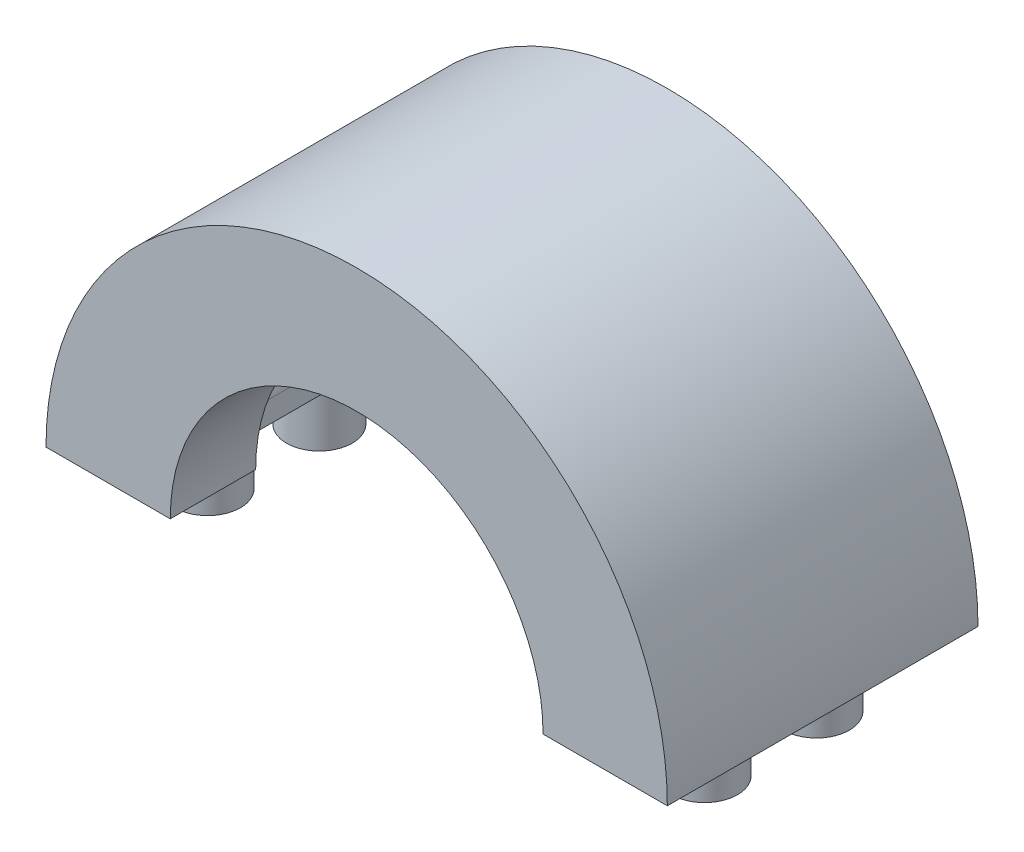
ISO-10303-21;
HEADER;
FILE_DESCRIPTION(('STEP AP214'),'2;1');
FILE_NAME('part.step','',(''),(''),'','','');
FILE_SCHEMA(('AUTOMOTIVE_DESIGN { 1 0 10303 214 1 1 1 1 }'));
ENDSEC;
DATA;
#1=APPLICATION_CONTEXT('core data for automotive mechanical design processes');
#2=APPLICATION_PROTOCOL_DEFINITION('international standard','automotive_design',2000,#1);
#3=PRODUCT_CONTEXT('',#1,'mechanical');
#4=PRODUCT('Part','Part','',(#3));
#5=PRODUCT_RELATED_PRODUCT_CATEGORY('part','',(#4));
#6=PRODUCT_DEFINITION_FORMATION('','',#4);
#7=PRODUCT_DEFINITION_CONTEXT('part definition',#1,'design');
#8=PRODUCT_DEFINITION('design','',#6,#7);
#9=PRODUCT_DEFINITION_SHAPE('','',#8);
#10=(LENGTH_UNIT() NAMED_UNIT(*) SI_UNIT(.MILLI.,.METRE.));
#11=(NAMED_UNIT(*) PLANE_ANGLE_UNIT() SI_UNIT($,.RADIAN.));
#12=(NAMED_UNIT(*) SI_UNIT($,.STERADIAN.) SOLID_ANGLE_UNIT());
#13=UNCERTAINTY_MEASURE_WITH_UNIT(LENGTH_MEASURE(1.E-05),#10,'distance_accuracy_value','');
#14=(GEOMETRIC_REPRESENTATION_CONTEXT(3) GLOBAL_UNCERTAINTY_ASSIGNED_CONTEXT((#13)) GLOBAL_UNIT_ASSIGNED_CONTEXT((#10,
#11,#12)) REPRESENTATION_CONTEXT('',''));
#15=CARTESIAN_POINT('',(0.,0.,0.));
#16=DIRECTION('',(0.,0.,1.));
#17=DIRECTION('',(1.,0.,0.));
#18=AXIS2_PLACEMENT_3D('',#15,#16,#17);
#19=CARTESIAN_POINT('',(0.,0.,12.5));
#20=DIRECTION('',(0.,0.,-1.));
#21=DIRECTION('',(-1.,0.,0.));
#22=AXIS2_PLACEMENT_3D('',#19,#20,#21);
#23=CYLINDRICAL_SURFACE('',#22,15.);
#24=DIRECTION('',(0.,0.,-1.));
#25=VECTOR('',#24,1.);
#26=CARTESIAN_POINT('',(12.6835301079786,8.008,5.628));
#27=LINE('',#26,#25);
#28=CARTESIAN_POINT('',(12.6835301079786,8.008,5.628));
#29=VERTEX_POINT('',#28);
#30=CARTESIAN_POINT('',(12.6835301079786,8.008,-5.628));
#31=VERTEX_POINT('',#30);
#32=EDGE_CURVE('E282',#29,#31,#27,.T.);
#33=ORIENTED_EDGE('',*,*,#32,.F.);
#34=CARTESIAN_POINT('',(0.,0.,5.628));
#35=DIRECTION('',(0.,0.,1.));
#36=DIRECTION('',(1.,0.,0.));
#37=AXIS2_PLACEMENT_3D('',#34,#35,#36);
#38=CIRCLE('',#37,15.);
#39=CARTESIAN_POINT('',(15.,0.,5.628));
#40=VERTEX_POINT('',#39);
#41=EDGE_CURVE('E262',#40,#29,#38,.T.);
#42=ORIENTED_EDGE('',*,*,#41,.F.);
#43=DIRECTION('',(0.,0.,-1.));
#44=VECTOR('',#43,1.);
#45=CARTESIAN_POINT('',(15.,0.,12.5));
#46=LINE('',#45,#44);
#47=CARTESIAN_POINT('',(15.,0.,12.5));
#48=VERTEX_POINT('',#47);
#49=EDGE_CURVE('E394',#48,#40,#46,.T.);
#50=ORIENTED_EDGE('',*,*,#49,.F.);
#51=CARTESIAN_POINT('',(0.,0.,12.5));
#52=DIRECTION('',(0.,0.,1.));
#53=DIRECTION('',(1.,0.,0.));
#54=AXIS2_PLACEMENT_3D('',#51,#52,#53);
#55=CIRCLE('',#54,15.);
#56=CARTESIAN_POINT('',(-15.,0.,12.5));
#57=VERTEX_POINT('',#56);
#58=EDGE_CURVE('E376',#48,#57,#55,.T.);
#59=ORIENTED_EDGE('',*,*,#58,.T.);
#60=DIRECTION('',(0.,0.,-1.));
#61=VECTOR('',#60,1.);
#62=CARTESIAN_POINT('',(-15.,0.,12.5));
#63=LINE('',#62,#61);
#64=CARTESIAN_POINT('',(-15.,0.,5.628));
#65=VERTEX_POINT('',#64);
#66=EDGE_CURVE('E399',#57,#65,#63,.T.);
#67=ORIENTED_EDGE('',*,*,#66,.T.);
#68=CARTESIAN_POINT('',(0.,0.,5.628));
#69=DIRECTION('',(0.,0.,-1.));
#70=DIRECTION('',(-1.,0.,0.));
#71=AXIS2_PLACEMENT_3D('',#68,#69,#70);
#72=CIRCLE('',#71,15.);
#73=CARTESIAN_POINT('',(-12.6835301079786,8.008,5.628));
#74=VERTEX_POINT('',#73);
#75=EDGE_CURVE('E312',#65,#74,#72,.T.);
#76=ORIENTED_EDGE('',*,*,#75,.T.);
#77=DIRECTION('',(0.,0.,-1.));
#78=VECTOR('',#77,1.);
#79=CARTESIAN_POINT('',(-12.6835301079786,8.008,5.628));
#80=LINE('',#79,#78);
#81=CARTESIAN_POINT('',(-12.6835301079786,8.008,-5.628));
#82=VERTEX_POINT('',#81);
#83=EDGE_CURVE('E354',#74,#82,#80,.T.);
#84=ORIENTED_EDGE('',*,*,#83,.T.);
#85=CARTESIAN_POINT('',(0.,0.,-5.628));
#86=DIRECTION('',(0.,0.,-1.));
#87=DIRECTION('',(-1.,0.,0.));
#88=AXIS2_PLACEMENT_3D('',#85,#86,#87);
#89=CIRCLE('',#88,15.);
#90=CARTESIAN_POINT('',(-15.,0.,-5.628));
#91=VERTEX_POINT('',#90);
#92=EDGE_CURVE('E305',#91,#82,#89,.T.);
#93=ORIENTED_EDGE('',*,*,#92,.F.);
#94=CARTESIAN_POINT('',(-15.,0.,-12.5));
#95=VERTEX_POINT('',#94);
#96=EDGE_CURVE('E398',#91,#95,#63,.T.);
#97=ORIENTED_EDGE('',*,*,#96,.T.);
#98=CARTESIAN_POINT('',(0.,0.,-12.5));
#99=DIRECTION('',(0.,0.,1.));
#100=DIRECTION('',(1.,0.,0.));
#101=AXIS2_PLACEMENT_3D('',#98,#99,#100);
#102=CIRCLE('',#101,15.);
#103=CARTESIAN_POINT('',(15.,0.,-12.5));
#104=VERTEX_POINT('',#103);
#105=EDGE_CURVE('E370',#104,#95,#102,.T.);
#106=ORIENTED_EDGE('',*,*,#105,.F.);
#107=CARTESIAN_POINT('',(15.,0.,-5.628));
#108=VERTEX_POINT('',#107);
#109=EDGE_CURVE('E380',#108,#104,#46,.T.);
#110=ORIENTED_EDGE('',*,*,#109,.F.);
#111=CARTESIAN_POINT('',(0.,0.,-5.628));
#112=DIRECTION('',(0.,0.,1.));
#113=DIRECTION('',(1.,0.,0.));
#114=AXIS2_PLACEMENT_3D('',#111,#112,#113);
#115=CIRCLE('',#114,15.);
#116=EDGE_CURVE('E257',#108,#31,#115,.T.);
#117=ORIENTED_EDGE('',*,*,#116,.T.);
#118=EDGE_LOOP('',(#33,#42,#50,#59,#67,#76,#84,#93,#97,#106,#110,#117));
#119=FACE_BOUND('',#118,.T.);
#120=ADVANCED_FACE('F41',(#119),#23,.F.);
#121=CARTESIAN_POINT('',(15.,0.,12.5));
#122=DIRECTION('',(0.,1.,0.));
#123=DIRECTION('',(-1.,0.,0.));
#124=AXIS2_PLACEMENT_3D('',#121,#122,#123);
#125=PLANE('',#124);
#126=DIRECTION('',(0.,0.,-1.));
#127=VECTOR('',#126,1.);
#128=CARTESIAN_POINT('',(17.5936,0.,-5.628));
#129=LINE('',#128,#127);
#130=CARTESIAN_POINT('',(17.5936,0.,3.3955457897676));
#131=VERTEX_POINT('',#130);
#132=CARTESIAN_POINT('',(17.5936,0.,-3.3955457897676));
#133=VERTEX_POINT('',#132);
#134=EDGE_CURVE('E218',#131,#133,#129,.T.);
#135=ORIENTED_EDGE('',*,*,#134,.T.);
#136=CARTESIAN_POINT('',(20.,0.,-4.5));
#137=DIRECTION('',(0.,1.,0.));
#138=DIRECTION('',(1.,0.,0.));
#139=AXIS2_PLACEMENT_3D('',#136,#137,#138);
#140=CIRCLE('',#139,2.64775);
#141=CARTESIAN_POINT('',(17.5936,0.,-5.6044542102324));
#142=VERTEX_POINT('',#141);
#143=EDGE_CURVE('E215',#133,#142,#140,.T.);
#144=ORIENTED_EDGE('',*,*,#143,.T.);
#145=CARTESIAN_POINT('',(17.5936,0.,-5.628));
#146=VERTEX_POINT('',#145);
#147=EDGE_CURVE('E201',#142,#146,#129,.T.);
#148=ORIENTED_EDGE('',*,*,#147,.T.);
#149=DIRECTION('',(1.,0.,0.));
#150=VECTOR('',#149,1.);
#151=CARTESIAN_POINT('',(0.,0.,-5.628));
#152=LINE('',#151,#150);
#153=EDGE_CURVE('E267',#108,#146,#152,.T.);
#154=ORIENTED_EDGE('',*,*,#153,.F.);
#155=ORIENTED_EDGE('',*,*,#109,.T.);
#156=DIRECTION('',(1.,0.,0.));
#157=VECTOR('',#156,1.);
#158=CARTESIAN_POINT('',(15.,0.,-12.5));
#159=LINE('',#158,#157);
#160=CARTESIAN_POINT('',(25.,0.,-12.5));
#161=VERTEX_POINT('',#160);
#162=EDGE_CURVE('E358',#104,#161,#159,.T.);
#163=ORIENTED_EDGE('',*,*,#162,.T.);
#164=DIRECTION('',(0.,0.,-1.));
#165=VECTOR('',#164,1.);
#166=CARTESIAN_POINT('',(25.,0.,12.5));
#167=LINE('',#166,#165);
#168=CARTESIAN_POINT('',(25.,0.,12.5));
#169=VERTEX_POINT('',#168);
#170=EDGE_CURVE('E407',#169,#161,#167,.T.);
#171=ORIENTED_EDGE('',*,*,#170,.F.);
#172=DIRECTION('',(1.,0.,0.));
#173=VECTOR('',#172,1.);
#174=CARTESIAN_POINT('',(15.,0.,12.5));
#175=LINE('',#174,#173);
#176=EDGE_CURVE('E365',#48,#169,#175,.T.);
#177=ORIENTED_EDGE('',*,*,#176,.F.);
#178=ORIENTED_EDGE('',*,*,#49,.T.);
#179=DIRECTION('',(1.,0.,0.));
#180=VECTOR('',#179,1.);
#181=CARTESIAN_POINT('',(0.,0.,5.628));
#182=LINE('',#181,#180);
#183=CARTESIAN_POINT('',(17.5936,0.,5.628));
#184=VERTEX_POINT('',#183);
#185=EDGE_CURVE('E279',#40,#184,#182,.T.);
#186=ORIENTED_EDGE('',*,*,#185,.T.);
#187=CARTESIAN_POINT('',(17.5936,0.,5.6044542102324));
#188=VERTEX_POINT('',#187);
#189=EDGE_CURVE('E213',#184,#188,#129,.T.);
#190=ORIENTED_EDGE('',*,*,#189,.T.);
#191=CARTESIAN_POINT('',(20.,0.,4.5));
#192=DIRECTION('',(0.,1.,0.));
#193=DIRECTION('',(-1.,0.,0.));
#194=AXIS2_PLACEMENT_3D('',#191,#192,#193);
#195=CIRCLE('',#194,2.64775);
#196=EDGE_CURVE('E241',#188,#131,#195,.T.);
#197=ORIENTED_EDGE('',*,*,#196,.T.);
#198=EDGE_LOOP('',(#135,#144,#148,#154,#155,#163,#171,#177,#178,#186,#190,#197));
#199=FACE_BOUND('',#198,.T.);
#200=ADVANCED_FACE('F216',(#199),#125,.F.);
#201=CARTESIAN_POINT('',(-25.,0.,12.5));
#202=DIRECTION('',(0.,1.,0.));
#203=DIRECTION('',(-1.,0.,0.));
#204=AXIS2_PLACEMENT_3D('',#201,#202,#203);
#205=PLANE('',#204);
#206=CARTESIAN_POINT('',(-20.,0.,-4.5));
#207=DIRECTION('',(0.,-1.,0.));
#208=DIRECTION('',(-1.,0.,0.));
#209=AXIS2_PLACEMENT_3D('',#206,#207,#208);
#210=CIRCLE('',#209,2.64775);
#211=CARTESIAN_POINT('',(-17.5936,0.,-3.39554578976763));
#212=VERTEX_POINT('',#211);
#213=CARTESIAN_POINT('',(-17.5936,0.,-5.60445421023237));
#214=VERTEX_POINT('',#213);
#215=EDGE_CURVE('E240',#212,#214,#210,.T.);
#216=ORIENTED_EDGE('',*,*,#215,.F.);
#217=DIRECTION('',(0.,0.,1.));
#218=VECTOR('',#217,1.);
#219=CARTESIAN_POINT('',(-17.5936,0.,12.5));
#220=LINE('',#219,#218);
#221=CARTESIAN_POINT('',(-17.5936,0.,3.39554578976763));
#222=VERTEX_POINT('',#221);
#223=EDGE_CURVE('E453',#212,#222,#220,.T.);
#224=ORIENTED_EDGE('',*,*,#223,.T.);
#225=CARTESIAN_POINT('',(-20.,0.,4.5));
#226=DIRECTION('',(0.,-1.,0.));
#227=DIRECTION('',(1.,0.,0.));
#228=AXIS2_PLACEMENT_3D('',#225,#226,#227);
#229=CIRCLE('',#228,2.64775);
#230=CARTESIAN_POINT('',(-17.5936,0.,5.60445421023237));
#231=VERTEX_POINT('',#230);
#232=EDGE_CURVE('E258',#231,#222,#229,.T.);
#233=ORIENTED_EDGE('',*,*,#232,.F.);
#234=CARTESIAN_POINT('',(-17.5936,0.,5.628));
#235=VERTEX_POINT('',#234);
#236=EDGE_CURVE('E447',#231,#235,#220,.T.);
#237=ORIENTED_EDGE('',*,*,#236,.T.);
#238=DIRECTION('',(-1.,0.,0.));
#239=VECTOR('',#238,1.);
#240=CARTESIAN_POINT('',(0.,0.,5.628));
#241=LINE('',#240,#239);
#242=EDGE_CURVE('E316',#65,#235,#241,.T.);
#243=ORIENTED_EDGE('',*,*,#242,.F.);
#244=ORIENTED_EDGE('',*,*,#66,.F.);
#245=DIRECTION('',(1.,0.,0.));
#246=VECTOR('',#245,1.);
#247=CARTESIAN_POINT('',(-25.,0.,12.5));
#248=LINE('',#247,#246);
#249=CARTESIAN_POINT('',(-25.,0.,12.5));
#250=VERTEX_POINT('',#249);
#251=EDGE_CURVE('E373',#250,#57,#248,.T.);
#252=ORIENTED_EDGE('',*,*,#251,.F.);
#253=DIRECTION('',(0.,0.,-1.));
#254=VECTOR('',#253,1.);
#255=CARTESIAN_POINT('',(-25.,0.,12.5));
#256=LINE('',#255,#254);
#257=CARTESIAN_POINT('',(-25.,0.,-12.5));
#258=VERTEX_POINT('',#257);
#259=EDGE_CURVE('E403',#250,#258,#256,.T.);
#260=ORIENTED_EDGE('',*,*,#259,.T.);
#261=DIRECTION('',(1.,0.,0.));
#262=VECTOR('',#261,1.);
#263=CARTESIAN_POINT('',(-25.,0.,-12.5));
#264=LINE('',#263,#262);
#265=EDGE_CURVE('E387',#258,#95,#264,.T.);
#266=ORIENTED_EDGE('',*,*,#265,.T.);
#267=ORIENTED_EDGE('',*,*,#96,.F.);
#268=DIRECTION('',(-1.,0.,0.));
#269=VECTOR('',#268,1.);
#270=CARTESIAN_POINT('',(0.,0.,-5.628));
#271=LINE('',#270,#269);
#272=CARTESIAN_POINT('',(-17.5936,0.,-5.628));
#273=VERTEX_POINT('',#272);
#274=EDGE_CURVE('E338',#91,#273,#271,.T.);
#275=ORIENTED_EDGE('',*,*,#274,.T.);
#276=EDGE_CURVE('E448',#273,#214,#220,.T.);
#277=ORIENTED_EDGE('',*,*,#276,.T.);
#278=EDGE_LOOP('',(#216,#224,#233,#237,#243,#244,#252,#260,#266,#267,#275,#277));
#279=FACE_BOUND('',#278,.T.);
#280=ADVANCED_FACE('F474',(#279),#205,.F.);
#281=CARTESIAN_POINT('',(0.,0.,12.5));
#282=DIRECTION('',(0.,0.,-1.));
#283=DIRECTION('',(-1.,0.,0.));
#284=AXIS2_PLACEMENT_3D('',#281,#282,#283);
#285=CYLINDRICAL_SURFACE('',#284,25.);
#286=CARTESIAN_POINT('',(0.,0.,-12.5));
#287=DIRECTION('',(0.,0.,1.));
#288=DIRECTION('',(1.,0.,0.));
#289=AXIS2_PLACEMENT_3D('',#286,#287,#288);
#290=CIRCLE('',#289,25.);
#291=EDGE_CURVE('E384',#161,#258,#290,.T.);
#292=ORIENTED_EDGE('',*,*,#291,.T.);
#293=ORIENTED_EDGE('',*,*,#259,.F.);
#294=CARTESIAN_POINT('',(0.,0.,12.5));
#295=DIRECTION('',(0.,0.,1.));
#296=DIRECTION('',(1.,0.,0.));
#297=AXIS2_PLACEMENT_3D('',#294,#295,#296);
#298=CIRCLE('',#297,25.);
#299=EDGE_CURVE('E369',#169,#250,#298,.T.);
#300=ORIENTED_EDGE('',*,*,#299,.F.);
#301=ORIENTED_EDGE('',*,*,#170,.T.);
#302=EDGE_LOOP('',(#292,#293,#300,#301));
#303=FACE_BOUND('',#302,.T.);
#304=ADVANCED_FACE('F552',(#303),#285,.T.);
#305=CARTESIAN_POINT('',(0.,0.,12.5));
#306=DIRECTION('',(0.,0.,1.));
#307=DIRECTION('',(1.,0.,0.));
#308=AXIS2_PLACEMENT_3D('',#305,#306,#307);
#309=PLANE('',#308);
#310=ORIENTED_EDGE('',*,*,#176,.T.);
#311=ORIENTED_EDGE('',*,*,#299,.T.);
#312=ORIENTED_EDGE('',*,*,#251,.T.);
#313=ORIENTED_EDGE('',*,*,#58,.F.);
#314=EDGE_LOOP('',(#310,#311,#312,#313));
#315=FACE_BOUND('',#314,.T.);
#316=ADVANCED_FACE('F554',(#315),#309,.T.);
#317=CARTESIAN_POINT('',(0.,0.,-12.5));
#318=DIRECTION('',(0.,0.,1.));
#319=DIRECTION('',(1.,0.,0.));
#320=AXIS2_PLACEMENT_3D('',#317,#318,#319);
#321=PLANE('',#320);
#322=ORIENTED_EDGE('',*,*,#162,.F.);
#323=ORIENTED_EDGE('',*,*,#105,.T.);
#324=ORIENTED_EDGE('',*,*,#265,.F.);
#325=ORIENTED_EDGE('',*,*,#291,.F.);
#326=EDGE_LOOP('',(#322,#323,#324,#325));
#327=FACE_BOUND('',#326,.T.);
#328=ADVANCED_FACE('F547',(#327),#321,.F.);
#329=CARTESIAN_POINT('',(0.,8.008,5.628));
#330=DIRECTION('',(0.,1.,0.));
#331=DIRECTION('',(0.,0.,1.));
#332=AXIS2_PLACEMENT_3D('',#329,#330,#331);
#333=PLANE('',#332);
#334=DIRECTION('',(1.,0.,0.));
#335=VECTOR('',#334,1.);
#336=CARTESIAN_POINT('',(0.,8.008,-5.628));
#337=LINE('',#336,#335);
#338=CARTESIAN_POINT('',(-16.6576,8.008,-5.628));
#339=VERTEX_POINT('',#338);
#340=EDGE_CURVE('E317',#339,#82,#337,.T.);
#341=ORIENTED_EDGE('',*,*,#340,.T.);
#342=ORIENTED_EDGE('',*,*,#83,.F.);
#343=DIRECTION('',(1.,0.,0.));
#344=VECTOR('',#343,1.);
#345=CARTESIAN_POINT('',(0.,8.008,5.628));
#346=LINE('',#345,#344);
#347=CARTESIAN_POINT('',(-16.6576,8.008,5.628));
#348=VERTEX_POINT('',#347);
#349=EDGE_CURVE('E331',#348,#74,#346,.T.);
#350=ORIENTED_EDGE('',*,*,#349,.F.);
#351=DIRECTION('',(0.,0.,-1.));
#352=VECTOR('',#351,1.);
#353=CARTESIAN_POINT('',(-16.6576,8.008,5.628));
#354=LINE('',#353,#352);
#355=EDGE_CURVE('E359',#348,#339,#354,.T.);
#356=ORIENTED_EDGE('',*,*,#355,.T.);
#357=EDGE_LOOP('',(#341,#342,#350,#356));
#358=FACE_BOUND('',#357,.T.);
#359=ADVANCED_FACE('F578',(#358),#333,.F.);
#360=CARTESIAN_POINT('',(-16.6576,0.,5.628));
#361=DIRECTION('',(-1.,0.,0.));
#362=DIRECTION('',(0.,0.,1.));
#363=AXIS2_PLACEMENT_3D('',#360,#361,#362);
#364=PLANE('',#363);
#365=DIRECTION('',(0.,1.,0.));
#366=VECTOR('',#365,1.);
#367=CARTESIAN_POINT('',(-16.6576,0.,-5.628));
#368=LINE('',#367,#366);
#369=CARTESIAN_POINT('',(-16.6576,5.712,-5.628));
#370=VERTEX_POINT('',#369);
#371=EDGE_CURVE('E347',#370,#339,#368,.T.);
#372=ORIENTED_EDGE('',*,*,#371,.T.);
#373=ORIENTED_EDGE('',*,*,#355,.F.);
#374=DIRECTION('',(0.,1.,0.));
#375=VECTOR('',#374,1.);
#376=CARTESIAN_POINT('',(-16.6576,0.,5.628));
#377=LINE('',#376,#375);
#378=CARTESIAN_POINT('',(-16.6576,5.712,5.628));
#379=VERTEX_POINT('',#378);
#380=EDGE_CURVE('E327',#379,#348,#377,.T.);
#381=ORIENTED_EDGE('',*,*,#380,.F.);
#382=DIRECTION('',(0.,0.,-1.));
#383=VECTOR('',#382,1.);
#384=CARTESIAN_POINT('',(-16.6576,5.712,5.628));
#385=LINE('',#384,#383);
#386=EDGE_CURVE('E335',#379,#370,#385,.T.);
#387=ORIENTED_EDGE('',*,*,#386,.T.);
#388=EDGE_LOOP('',(#372,#373,#381,#387));
#389=FACE_BOUND('',#388,.T.);
#390=ADVANCED_FACE('F575',(#389),#364,.F.);
#391=CARTESIAN_POINT('',(-6.31784738154612,-5.71614763092269,5.628));
#392=DIRECTION('',(-0.741535779123771,-0.670913323969127,0.));
#393=DIRECTION('',(0.670913323969127,-0.741535779123771,0.));
#394=AXIS2_PLACEMENT_3D('',#391,#392,#393);
#395=PLANE('',#394);
#396=DIRECTION('',(-0.670913323969127,0.741535779123771,0.));
#397=VECTOR('',#396,1.);
#398=CARTESIAN_POINT('',(-6.31784738154612,-5.71614763092269,5.628));
#399=LINE('',#398,#397);
#400=CARTESIAN_POINT('',(-16.1105284417525,5.10734196193693,5.628));
#401=VERTEX_POINT('',#400);
#402=EDGE_CURVE('E324',#401,#379,#399,.T.);
#403=ORIENTED_EDGE('',*,*,#402,.F.);
#404=DIRECTION('',(0.,0.,-1.));
#405=VECTOR('',#404,1.);
#406=CARTESIAN_POINT('',(-16.1105284417525,5.10734196193693,5.628));
#407=LINE('',#406,#405);
#408=CARTESIAN_POINT('',(-16.1105284417525,5.10734196193693,-5.628));
#409=VERTEX_POINT('',#408);
#410=EDGE_CURVE('E418',#401,#409,#407,.T.);
#411=ORIENTED_EDGE('',*,*,#410,.T.);
#412=DIRECTION('',(-0.670913323969127,0.741535779123771,0.));
#413=VECTOR('',#412,1.);
#414=CARTESIAN_POINT('',(-6.31784738154612,-5.71614763092269,-5.628));
#415=LINE('',#414,#413);
#416=EDGE_CURVE('E344',#409,#370,#415,.T.);
#417=ORIENTED_EDGE('',*,*,#416,.T.);
#418=ORIENTED_EDGE('',*,*,#386,.F.);
#419=EDGE_LOOP('',(#403,#411,#417,#418));
#420=FACE_BOUND('',#419,.T.);
#421=ADVANCED_FACE('F568',(#420),#395,.F.);
#422=CARTESIAN_POINT('',(-15.5936,0.,5.628));
#423=DIRECTION('',(-1.,0.,0.));
#424=DIRECTION('',(0.,0.,1.));
#425=AXIS2_PLACEMENT_3D('',#422,#423,#424);
#426=PLANE('',#425);
#427=DIRECTION('',(0.,1.,0.));
#428=VECTOR('',#427,1.);
#429=CARTESIAN_POINT('',(-15.5936,0.,5.628));
#430=LINE('',#429,#428);
#431=CARTESIAN_POINT('',(-15.5936,2.00000000000001,5.628));
#432=VERTEX_POINT('',#431);
#433=CARTESIAN_POINT('',(-15.5936,3.76551531399867,5.628));
#434=VERTEX_POINT('',#433);
#435=EDGE_CURVE('E321',#432,#434,#430,.T.);
#436=ORIENTED_EDGE('',*,*,#435,.F.);
#437=DIRECTION('',(0.,0.,-1.));
#438=VECTOR('',#437,1.);
#439=CARTESIAN_POINT('',(-15.5936,2.00000000000001,5.628));
#440=LINE('',#439,#438);
#441=CARTESIAN_POINT('',(-15.5936,2.00000000000001,-5.628));
#442=VERTEX_POINT('',#441);
#443=EDGE_CURVE('E443',#432,#442,#440,.T.);
#444=ORIENTED_EDGE('',*,*,#443,.T.);
#445=DIRECTION('',(0.,1.,0.));
#446=VECTOR('',#445,1.);
#447=CARTESIAN_POINT('',(-15.5936,0.,-5.628));
#448=LINE('',#447,#446);
#449=CARTESIAN_POINT('',(-15.5936,3.76551531399867,-5.628));
#450=VERTEX_POINT('',#449);
#451=EDGE_CURVE('E341',#442,#450,#448,.T.);
#452=ORIENTED_EDGE('',*,*,#451,.T.);
#453=DIRECTION('',(0.,0.,-1.));
#454=VECTOR('',#453,1.);
#455=CARTESIAN_POINT('',(-15.5936,3.76551531399867,5.628));
#456=LINE('',#455,#454);
#457=EDGE_CURVE('E422',#450,#434,#456,.F.);
#458=ORIENTED_EDGE('',*,*,#457,.T.);
#459=EDGE_LOOP('',(#436,#444,#452,#458));
#460=FACE_BOUND('',#459,.T.);
#461=ADVANCED_FACE('F560',(#460),#426,.F.);
#462=CARTESIAN_POINT('',(0.,0.,5.628));
#463=DIRECTION('',(0.,0.,-1.));
#464=DIRECTION('',(-1.,0.,0.));
#465=AXIS2_PLACEMENT_3D('',#462,#463,#464);
#466=PLANE('',#465);
#467=ORIENTED_EDGE('',*,*,#75,.F.);
#468=ORIENTED_EDGE('',*,*,#242,.T.);
#469=DIRECTION('',(-0.707106781186549,-0.707106781186546,0.));
#470=VECTOR('',#469,1.);
#471=CARTESIAN_POINT('',(-15.5936,2.00000000000001,5.628));
#472=LINE('',#471,#470);
#473=EDGE_CURVE('E11',#235,#432,#472,.F.);
#474=ORIENTED_EDGE('',*,*,#473,.T.);
#475=ORIENTED_EDGE('',*,*,#435,.T.);
#476=CARTESIAN_POINT('',(-17.5936,3.76551531399867,5.628));
#477=DIRECTION('',(0.,0.,-1.));
#478=DIRECTION('',(-1.,0.,0.));
#479=AXIS2_PLACEMENT_3D('',#476,#477,#478);
#480=CIRCLE('',#479,2.);
#481=EDGE_CURVE('E211',#434,#401,#480,.F.);
#482=ORIENTED_EDGE('',*,*,#481,.T.);
#483=ORIENTED_EDGE('',*,*,#402,.T.);
#484=ORIENTED_EDGE('',*,*,#380,.T.);
#485=ORIENTED_EDGE('',*,*,#349,.T.);
#486=EDGE_LOOP('',(#467,#468,#474,#475,#482,#483,#484,#485));
#487=FACE_BOUND('',#486,.T.);
#488=ADVANCED_FACE('F557',(#487),#466,.T.);
#489=CARTESIAN_POINT('',(0.,0.,-5.628));
#490=DIRECTION('',(0.,0.,-1.));
#491=DIRECTION('',(-1.,0.,0.));
#492=AXIS2_PLACEMENT_3D('',#489,#490,#491);
#493=PLANE('',#492);
#494=ORIENTED_EDGE('',*,*,#92,.T.);
#495=ORIENTED_EDGE('',*,*,#340,.F.);
#496=ORIENTED_EDGE('',*,*,#371,.F.);
#497=ORIENTED_EDGE('',*,*,#416,.F.);
#498=CARTESIAN_POINT('',(-17.5936,3.76551531399867,-5.628));
#499=DIRECTION('',(0.,0.,-1.));
#500=DIRECTION('',(-1.,0.,0.));
#501=AXIS2_PLACEMENT_3D('',#498,#499,#500);
#502=CIRCLE('',#501,2.);
#503=EDGE_CURVE('E433',#409,#450,#502,.T.);
#504=ORIENTED_EDGE('',*,*,#503,.T.);
#505=ORIENTED_EDGE('',*,*,#451,.F.);
#506=DIRECTION('',(0.707106781186549,0.707106781186546,0.));
#507=VECTOR('',#506,1.);
#508=CARTESIAN_POINT('',(-8.79679999999998,8.79680000000001,-5.628));
#509=LINE('',#508,#507);
#510=EDGE_CURVE('E51',#442,#273,#509,.F.);
#511=ORIENTED_EDGE('',*,*,#510,.T.);
#512=ORIENTED_EDGE('',*,*,#274,.F.);
#513=EDGE_LOOP('',(#494,#495,#496,#497,#504,#505,#511,#512));
#514=FACE_BOUND('',#513,.T.);
#515=ADVANCED_FACE('F465',(#514),#493,.F.);
#516=CARTESIAN_POINT('',(15.5936,0.,5.628));
#517=DIRECTION('',(-1.,0.,0.));
#518=DIRECTION('',(0.,0.,1.));
#519=AXIS2_PLACEMENT_3D('',#516,#517,#518);
#520=PLANE('',#519);
#521=DIRECTION('',(0.,1.,0.));
#522=VECTOR('',#521,1.);
#523=CARTESIAN_POINT('',(15.5936,0.,-5.628));
#524=LINE('',#523,#522);
#525=CARTESIAN_POINT('',(15.5936,2.00000000000002,-5.628));
#526=VERTEX_POINT('',#525);
#527=CARTESIAN_POINT('',(15.5936,3.76551531399867,-5.628));
#528=VERTEX_POINT('',#527);
#529=EDGE_CURVE('E296',#526,#528,#524,.T.);
#530=ORIENTED_EDGE('',*,*,#529,.F.);
#531=DIRECTION('',(0.,0.,1.));
#532=VECTOR('',#531,1.);
#533=CARTESIAN_POINT('',(15.5936,2.00000000000002,5.628));
#534=LINE('',#533,#532);
#535=CARTESIAN_POINT('',(15.5936,2.00000000000002,5.628));
#536=VERTEX_POINT('',#535);
#537=EDGE_CURVE('E440',#526,#536,#534,.T.);
#538=ORIENTED_EDGE('',*,*,#537,.T.);
#539=DIRECTION('',(0.,1.,0.));
#540=VECTOR('',#539,1.);
#541=CARTESIAN_POINT('',(15.5936,0.,5.628));
#542=LINE('',#541,#540);
#543=CARTESIAN_POINT('',(15.5936,3.76551531399867,5.628));
#544=VERTEX_POINT('',#543);
#545=EDGE_CURVE('E276',#536,#544,#542,.T.);
#546=ORIENTED_EDGE('',*,*,#545,.T.);
#547=DIRECTION('',(0.,0.,-1.));
#548=VECTOR('',#547,1.);
#549=CARTESIAN_POINT('',(15.5936,3.76551531399867,5.628));
#550=LINE('',#549,#548);
#551=EDGE_CURVE('E411',#544,#528,#550,.T.);
#552=ORIENTED_EDGE('',*,*,#551,.T.);
#553=EDGE_LOOP('',(#530,#538,#546,#552));
#554=FACE_BOUND('',#553,.T.);
#555=ADVANCED_FACE('F514',(#554),#520,.T.);
#556=CARTESIAN_POINT('',(6.31784738154612,-5.71614763092269,5.628));
#557=DIRECTION('',(-0.741535779123771,0.670913323969127,0.));
#558=DIRECTION('',(-0.670913323969127,-0.741535779123771,0.));
#559=AXIS2_PLACEMENT_3D('',#556,#557,#558);
#560=PLANE('',#559);
#561=DIRECTION('',(0.670913323969127,0.741535779123771,0.));
#562=VECTOR('',#561,1.);
#563=CARTESIAN_POINT('',(6.31784738154612,-5.71614763092269,-5.628));
#564=LINE('',#563,#562);
#565=CARTESIAN_POINT('',(16.1105284417525,5.10734196193693,-5.628));
#566=VERTEX_POINT('',#565);
#567=CARTESIAN_POINT('',(16.6576,5.712,-5.628));
#568=VERTEX_POINT('',#567);
#569=EDGE_CURVE('E293',#566,#568,#564,.T.);
#570=ORIENTED_EDGE('',*,*,#569,.F.);
#571=DIRECTION('',(0.,0.,-1.));
#572=VECTOR('',#571,1.);
#573=CARTESIAN_POINT('',(16.1105284417525,5.10734196193693,5.628));
#574=LINE('',#573,#572);
#575=CARTESIAN_POINT('',(16.1105284417525,5.10734196193693,5.628));
#576=VERTEX_POINT('',#575);
#577=EDGE_CURVE('E415',#566,#576,#574,.F.);
#578=ORIENTED_EDGE('',*,*,#577,.T.);
#579=DIRECTION('',(0.670913323969127,0.741535779123771,0.));
#580=VECTOR('',#579,1.);
#581=CARTESIAN_POINT('',(6.31784738154612,-5.71614763092269,5.628));
#582=LINE('',#581,#580);
#583=CARTESIAN_POINT('',(16.6576,5.712,5.628));
#584=VERTEX_POINT('',#583);
#585=EDGE_CURVE('E273',#576,#584,#582,.T.);
#586=ORIENTED_EDGE('',*,*,#585,.T.);
#587=DIRECTION('',(0.,0.,-1.));
#588=VECTOR('',#587,1.);
#589=CARTESIAN_POINT('',(16.6576,5.712,5.628));
#590=LINE('',#589,#588);
#591=EDGE_CURVE('E301',#584,#568,#590,.T.);
#592=ORIENTED_EDGE('',*,*,#591,.T.);
#593=EDGE_LOOP('',(#570,#578,#586,#592));
#594=FACE_BOUND('',#593,.T.);
#595=ADVANCED_FACE('F523',(#594),#560,.T.);
#596=CARTESIAN_POINT('',(16.6576,0.,5.628));
#597=DIRECTION('',(-1.,0.,0.));
#598=DIRECTION('',(0.,0.,1.));
#599=AXIS2_PLACEMENT_3D('',#596,#597,#598);
#600=PLANE('',#599);
#601=DIRECTION('',(0.,1.,0.));
#602=VECTOR('',#601,1.);
#603=CARTESIAN_POINT('',(16.6576,0.,-5.628));
#604=LINE('',#603,#602);
#605=CARTESIAN_POINT('',(16.6576,8.008,-5.628));
#606=VERTEX_POINT('',#605);
#607=EDGE_CURVE('E290',#568,#606,#604,.T.);
#608=ORIENTED_EDGE('',*,*,#607,.F.);
#609=ORIENTED_EDGE('',*,*,#591,.F.);
#610=DIRECTION('',(0.,1.,0.));
#611=VECTOR('',#610,1.);
#612=CARTESIAN_POINT('',(16.6576,0.,5.628));
#613=LINE('',#612,#611);
#614=CARTESIAN_POINT('',(16.6576,8.008,5.628));
#615=VERTEX_POINT('',#614);
#616=EDGE_CURVE('E270',#584,#615,#613,.T.);
#617=ORIENTED_EDGE('',*,*,#616,.T.);
#618=DIRECTION('',(0.,0.,-1.));
#619=VECTOR('',#618,1.);
#620=CARTESIAN_POINT('',(16.6576,8.008,5.628));
#621=LINE('',#620,#619);
#622=EDGE_CURVE('E306',#615,#606,#621,.T.);
#623=ORIENTED_EDGE('',*,*,#622,.T.);
#624=EDGE_LOOP('',(#608,#609,#617,#623));
#625=FACE_BOUND('',#624,.T.);
#626=ADVANCED_FACE('F530',(#625),#600,.T.);
#627=CARTESIAN_POINT('',(0.,8.008,5.628));
#628=DIRECTION('',(0.,-1.,0.));
#629=DIRECTION('',(0.,0.,-1.));
#630=AXIS2_PLACEMENT_3D('',#627,#628,#629);
#631=PLANE('',#630);
#632=DIRECTION('',(-1.,0.,0.));
#633=VECTOR('',#632,1.);
#634=CARTESIAN_POINT('',(0.,8.008,-5.628));
#635=LINE('',#634,#633);
#636=EDGE_CURVE('E286',#606,#31,#635,.T.);
#637=ORIENTED_EDGE('',*,*,#636,.F.);
#638=ORIENTED_EDGE('',*,*,#622,.F.);
#639=DIRECTION('',(-1.,0.,0.));
#640=VECTOR('',#639,1.);
#641=CARTESIAN_POINT('',(0.,8.008,5.628));
#642=LINE('',#641,#640);
#643=EDGE_CURVE('E266',#615,#29,#642,.T.);
#644=ORIENTED_EDGE('',*,*,#643,.T.);
#645=ORIENTED_EDGE('',*,*,#32,.T.);
#646=EDGE_LOOP('',(#637,#638,#644,#645));
#647=FACE_BOUND('',#646,.T.);
#648=ADVANCED_FACE('F533',(#647),#631,.T.);
#649=CARTESIAN_POINT('',(0.,0.,5.628));
#650=DIRECTION('',(0.,0.,-1.));
#651=DIRECTION('',(1.,0.,0.));
#652=AXIS2_PLACEMENT_3D('',#649,#650,#651);
#653=PLANE('',#652);
#654=ORIENTED_EDGE('',*,*,#41,.T.);
#655=ORIENTED_EDGE('',*,*,#643,.F.);
#656=ORIENTED_EDGE('',*,*,#616,.F.);
#657=ORIENTED_EDGE('',*,*,#585,.F.);
#658=CARTESIAN_POINT('',(17.5936,3.76551531399867,5.628));
#659=DIRECTION('',(0.,0.,-1.));
#660=DIRECTION('',(-1.,0.,0.));
#661=AXIS2_PLACEMENT_3D('',#658,#659,#660);
#662=CIRCLE('',#661,2.);
#663=EDGE_CURVE('E429',#576,#544,#662,.F.);
#664=ORIENTED_EDGE('',*,*,#663,.T.);
#665=ORIENTED_EDGE('',*,*,#545,.F.);
#666=DIRECTION('',(0.707106781186546,-0.707106781186549,0.));
#667=VECTOR('',#666,1.);
#668=CARTESIAN_POINT('',(17.5936,0.,5.628));
#669=LINE('',#668,#667);
#670=EDGE_CURVE('E457',#536,#184,#669,.T.);
#671=ORIENTED_EDGE('',*,*,#670,.T.);
#672=ORIENTED_EDGE('',*,*,#185,.F.);
#673=EDGE_LOOP('',(#654,#655,#656,#657,#664,#665,#671,#672));
#674=FACE_BOUND('',#673,.T.);
#675=ADVANCED_FACE('F507',(#674),#653,.T.);
#676=CARTESIAN_POINT('',(0.,0.,-5.628));
#677=DIRECTION('',(0.,0.,-1.));
#678=DIRECTION('',(1.,0.,0.));
#679=AXIS2_PLACEMENT_3D('',#676,#677,#678);
#680=PLANE('',#679);
#681=ORIENTED_EDGE('',*,*,#116,.F.);
#682=ORIENTED_EDGE('',*,*,#153,.T.);
#683=DIRECTION('',(-0.707106781186546,0.707106781186549,0.));
#684=VECTOR('',#683,1.);
#685=CARTESIAN_POINT('',(8.79680000000005,8.7968,-5.628));
#686=LINE('',#685,#684);
#687=EDGE_CURVE('E206',#146,#526,#686,.T.);
#688=ORIENTED_EDGE('',*,*,#687,.T.);
#689=ORIENTED_EDGE('',*,*,#529,.T.);
#690=CARTESIAN_POINT('',(17.5936,3.76551531399867,-5.628));
#691=DIRECTION('',(0.,0.,-1.));
#692=DIRECTION('',(-1.,0.,0.));
#693=AXIS2_PLACEMENT_3D('',#690,#691,#692);
#694=CIRCLE('',#693,2.);
#695=EDGE_CURVE('E426',#528,#566,#694,.T.);
#696=ORIENTED_EDGE('',*,*,#695,.T.);
#697=ORIENTED_EDGE('',*,*,#569,.T.);
#698=ORIENTED_EDGE('',*,*,#607,.T.);
#699=ORIENTED_EDGE('',*,*,#636,.T.);
#700=EDGE_LOOP('',(#681,#682,#688,#689,#696,#697,#698,#699));
#701=FACE_BOUND('',#700,.T.);
#702=ADVANCED_FACE('F517',(#701),#680,.F.);
#703=CARTESIAN_POINT('',(17.5936,3.76551531399867,5.628));
#704=DIRECTION('',(0.,0.,-1.));
#705=DIRECTION('',(-1.,0.,0.));
#706=AXIS2_PLACEMENT_3D('',#703,#704,#705);
#707=CYLINDRICAL_SURFACE('',#706,2.);
#708=ORIENTED_EDGE('',*,*,#663,.F.);
#709=ORIENTED_EDGE('',*,*,#577,.F.);
#710=ORIENTED_EDGE('',*,*,#695,.F.);
#711=ORIENTED_EDGE('',*,*,#551,.F.);
#712=EDGE_LOOP('',(#708,#709,#710,#711));
#713=FACE_BOUND('',#712,.T.);
#714=ADVANCED_FACE('F521',(#713),#707,.T.);
#715=CARTESIAN_POINT('',(-17.5936,3.76551531399867,5.628));
#716=DIRECTION('',(0.,0.,-1.));
#717=DIRECTION('',(-1.,0.,0.));
#718=AXIS2_PLACEMENT_3D('',#715,#716,#717);
#719=CYLINDRICAL_SURFACE('',#718,2.);
#720=ORIENTED_EDGE('',*,*,#481,.F.);
#721=ORIENTED_EDGE('',*,*,#457,.F.);
#722=ORIENTED_EDGE('',*,*,#503,.F.);
#723=ORIENTED_EDGE('',*,*,#410,.F.);
#724=EDGE_LOOP('',(#720,#721,#722,#723));
#725=FACE_BOUND('',#724,.T.);
#726=ADVANCED_FACE('F571',(#725),#719,.T.);
#727=CARTESIAN_POINT('',(17.5936,0.,12.5));
#728=DIRECTION('',(-0.707106781186549,-0.707106781186546,0.));
#729=DIRECTION('',(0.,0.,1.));
#730=AXIS2_PLACEMENT_3D('',#727,#728,#729);
#731=PLANE('',#730);
#732=ORIENTED_EDGE('',*,*,#670,.F.);
#733=ORIENTED_EDGE('',*,*,#537,.F.);
#734=ORIENTED_EDGE('',*,*,#687,.F.);
#735=ORIENTED_EDGE('',*,*,#147,.F.);
#736=EDGE_CURVE('E58',#133,#142,#129,.T.);
#737=ORIENTED_EDGE('',*,*,#736,.F.);
#738=ORIENTED_EDGE('',*,*,#134,.F.);
#739=EDGE_CURVE('E64',#188,#131,#129,.T.);
#740=ORIENTED_EDGE('',*,*,#739,.F.);
#741=ORIENTED_EDGE('',*,*,#189,.F.);
#742=EDGE_LOOP('',(#732,#733,#734,#735,#737,#738,#740,#741));
#743=FACE_BOUND('',#742,.T.);
#744=ADVANCED_FACE('F204',(#743),#731,.T.);
#745=CARTESIAN_POINT('',(-15.5936,2.00000000000001,5.628));
#746=DIRECTION('',(-0.707106781186546,0.707106781186549,0.));
#747=DIRECTION('',(0.,0.,-1.));
#748=AXIS2_PLACEMENT_3D('',#745,#746,#747);
#749=PLANE('',#748);
#750=ORIENTED_EDGE('',*,*,#473,.F.);
#751=ORIENTED_EDGE('',*,*,#236,.F.);
#752=EDGE_CURVE('E454',#222,#231,#220,.T.);
#753=ORIENTED_EDGE('',*,*,#752,.F.);
#754=ORIENTED_EDGE('',*,*,#223,.F.);
#755=EDGE_CURVE('E452',#214,#212,#220,.T.);
#756=ORIENTED_EDGE('',*,*,#755,.F.);
#757=ORIENTED_EDGE('',*,*,#276,.F.);
#758=ORIENTED_EDGE('',*,*,#510,.F.);
#759=ORIENTED_EDGE('',*,*,#443,.F.);
#760=EDGE_LOOP('',(#750,#751,#753,#754,#756,#757,#758,#759));
#761=FACE_BOUND('',#760,.T.);
#762=ADVANCED_FACE('F44',(#761),#749,.F.);
#763=CARTESIAN_POINT('',(-20.,-4.40549999999998,4.5));
#764=DIRECTION('',(0.,1.,0.));
#765=DIRECTION('',(-1.,0.,0.));
#766=AXIS2_PLACEMENT_3D('',#763,#764,#765);
#767=CYLINDRICAL_SURFACE('',#766,2.64775);
#768=CARTESIAN_POINT('',(-20.,-4.40549999999998,4.5));
#769=DIRECTION('',(0.,-1.,0.));
#770=DIRECTION('',(1.,0.,0.));
#771=AXIS2_PLACEMENT_3D('',#768,#769,#770);
#772=CIRCLE('',#771,2.64775);
#773=CARTESIAN_POINT('',(-17.35225,-4.40549999999998,4.5));
#774=VERTEX_POINT('',#773);
#775=EDGE_CURVE('E253',#774,#774,#772,.T.);
#776=ORIENTED_EDGE('',*,*,#775,.F.);
#777=EDGE_LOOP('',(#776));
#778=FACE_BOUND('',#777,.T.);
#779=ORIENTED_EDGE('',*,*,#232,.T.);
#780=EDGE_CURVE('E248',#222,#231,#229,.T.);
#781=ORIENTED_EDGE('',*,*,#780,.T.);
#782=EDGE_LOOP('',(#779,#781));
#783=FACE_BOUND('',#782,.T.);
#784=ADVANCED_FACE('F495',(#778,#783),#767,.T.);
#785=CARTESIAN_POINT('',(-20.,-4.40549999999998,4.5));
#786=DIRECTION('',(0.,-1.,0.));
#787=DIRECTION('',(1.,0.,0.));
#788=AXIS2_PLACEMENT_3D('',#785,#786,#787);
#789=PLANE('',#788);
#790=ORIENTED_EDGE('',*,*,#775,.T.);
#791=EDGE_LOOP('',(#790));
#792=FACE_BOUND('',#791,.T.);
#793=ADVANCED_FACE('F613',(#792),#789,.T.);
#794=CARTESIAN_POINT('',(-20.,0.,4.5));
#795=DIRECTION('',(0.,-1.,0.));
#796=DIRECTION('',(1.,0.,0.));
#797=AXIS2_PLACEMENT_3D('',#794,#795,#796);
#798=PLANE('',#797);
#799=ORIENTED_EDGE('',*,*,#752,.T.);
#800=ORIENTED_EDGE('',*,*,#780,.F.);
#801=EDGE_LOOP('',(#799,#800));
#802=FACE_BOUND('',#801,.T.);
#803=ADVANCED_FACE('F493',(#802),#798,.F.);
#804=CARTESIAN_POINT('',(-20.,-4.40549999999998,-4.5));
#805=DIRECTION('',(0.,1.,0.));
#806=DIRECTION('',(-1.,0.,0.));
#807=AXIS2_PLACEMENT_3D('',#804,#805,#806);
#808=CYLINDRICAL_SURFACE('',#807,2.64775);
#809=CARTESIAN_POINT('',(-20.,-4.40549999999998,-4.5));
#810=DIRECTION('',(0.,-1.,0.));
#811=DIRECTION('',(-1.,0.,0.));
#812=AXIS2_PLACEMENT_3D('',#809,#810,#811);
#813=CIRCLE('',#812,2.64775);
#814=CARTESIAN_POINT('',(-22.64775,-4.40549999999998,-4.5));
#815=VERTEX_POINT('',#814);
#816=EDGE_CURVE('E244',#815,#815,#813,.T.);
#817=ORIENTED_EDGE('',*,*,#816,.F.);
#818=EDGE_LOOP('',(#817));
#819=FACE_BOUND('',#818,.T.);
#820=EDGE_CURVE('E249',#214,#212,#210,.T.);
#821=ORIENTED_EDGE('',*,*,#820,.T.);
#822=ORIENTED_EDGE('',*,*,#215,.T.);
#823=EDGE_LOOP('',(#821,#822));
#824=FACE_BOUND('',#823,.T.);
#825=ADVANCED_FACE('F478',(#819,#824),#808,.T.);
#826=CARTESIAN_POINT('',(-20.,-4.40549999999998,-4.5));
#827=DIRECTION('',(0.,1.,0.));
#828=DIRECTION('',(-1.,0.,0.));
#829=AXIS2_PLACEMENT_3D('',#826,#827,#828);
#830=PLANE('',#829);
#831=ORIENTED_EDGE('',*,*,#816,.T.);
#832=EDGE_LOOP('',(#831));
#833=FACE_BOUND('',#832,.T.);
#834=ADVANCED_FACE('F794',(#833),#830,.F.);
#835=CARTESIAN_POINT('',(-20.,0.,-4.5));
#836=DIRECTION('',(0.,1.,0.));
#837=DIRECTION('',(-1.,0.,0.));
#838=AXIS2_PLACEMENT_3D('',#835,#836,#837);
#839=PLANE('',#838);
#840=ORIENTED_EDGE('',*,*,#820,.F.);
#841=ORIENTED_EDGE('',*,*,#755,.T.);
#842=EDGE_LOOP('',(#840,#841));
#843=FACE_BOUND('',#842,.T.);
#844=ADVANCED_FACE('F481',(#843),#839,.T.);
#845=CARTESIAN_POINT('',(20.,-4.40549999999998,4.5));
#846=DIRECTION('',(0.,1.,0.));
#847=DIRECTION('',(-1.,0.,0.));
#848=AXIS2_PLACEMENT_3D('',#845,#846,#847);
#849=CYLINDRICAL_SURFACE('',#848,2.64775);
#850=CARTESIAN_POINT('',(20.,-4.40549999999998,4.5));
#851=DIRECTION('',(0.,1.,0.));
#852=DIRECTION('',(-1.,0.,0.));
#853=AXIS2_PLACEMENT_3D('',#850,#851,#852);
#854=CIRCLE('',#853,2.64775);
#855=CARTESIAN_POINT('',(17.35225,-4.40549999999998,4.5));
#856=VERTEX_POINT('',#855);
#857=EDGE_CURVE('E236',#856,#856,#854,.T.);
#858=ORIENTED_EDGE('',*,*,#857,.T.);
#859=EDGE_LOOP('',(#858));
#860=FACE_BOUND('',#859,.T.);
#861=ORIENTED_EDGE('',*,*,#196,.F.);
#862=EDGE_CURVE('E233',#131,#188,#195,.T.);
#863=ORIENTED_EDGE('',*,*,#862,.F.);
#864=EDGE_LOOP('',(#861,#863));
#865=FACE_BOUND('',#864,.T.);
#866=ADVANCED_FACE('F504',(#860,#865),#849,.T.);
#867=CARTESIAN_POINT('',(20.,-4.40549999999998,4.5));
#868=DIRECTION('',(0.,-1.,0.));
#869=DIRECTION('',(-1.,0.,0.));
#870=AXIS2_PLACEMENT_3D('',#867,#868,#869);
#871=PLANE('',#870);
#872=ORIENTED_EDGE('',*,*,#857,.F.);
#873=EDGE_LOOP('',(#872));
#874=FACE_BOUND('',#873,.T.);
#875=ADVANCED_FACE('F820',(#874),#871,.T.);
#876=CARTESIAN_POINT('',(20.,0.,4.5));
#877=DIRECTION('',(0.,-1.,0.));
#878=DIRECTION('',(-1.,0.,0.));
#879=AXIS2_PLACEMENT_3D('',#876,#877,#878);
#880=PLANE('',#879);
#881=ORIENTED_EDGE('',*,*,#739,.T.);
#882=ORIENTED_EDGE('',*,*,#862,.T.);
#883=EDGE_LOOP('',(#881,#882));
#884=FACE_BOUND('',#883,.T.);
#885=ADVANCED_FACE('F502',(#884),#880,.F.);
#886=CARTESIAN_POINT('',(20.,-4.40549999999998,-4.5));
#887=DIRECTION('',(0.,1.,0.));
#888=DIRECTION('',(-1.,0.,0.));
#889=AXIS2_PLACEMENT_3D('',#886,#887,#888);
#890=CYLINDRICAL_SURFACE('',#889,2.64775);
#891=CARTESIAN_POINT('',(20.,-4.40549999999998,-4.5));
#892=DIRECTION('',(0.,1.,0.));
#893=DIRECTION('',(1.,0.,0.));
#894=AXIS2_PLACEMENT_3D('',#891,#892,#893);
#895=CIRCLE('',#894,2.64775);
#896=CARTESIAN_POINT('',(22.64775,-4.40549999999998,-4.5));
#897=VERTEX_POINT('',#896);
#898=EDGE_CURVE('E230',#897,#897,#895,.T.);
#899=ORIENTED_EDGE('',*,*,#898,.T.);
#900=EDGE_LOOP('',(#899));
#901=FACE_BOUND('',#900,.T.);
#902=EDGE_CURVE('E223',#142,#133,#140,.T.);
#903=ORIENTED_EDGE('',*,*,#902,.F.);
#904=ORIENTED_EDGE('',*,*,#143,.F.);
#905=EDGE_LOOP('',(#903,#904));
#906=FACE_BOUND('',#905,.T.);
#907=ADVANCED_FACE('F228',(#901,#906),#890,.T.);
#908=CARTESIAN_POINT('',(20.,-4.40549999999998,-4.5));
#909=DIRECTION('',(0.,1.,0.));
#910=DIRECTION('',(1.,0.,0.));
#911=AXIS2_PLACEMENT_3D('',#908,#909,#910);
#912=PLANE('',#911);
#913=ORIENTED_EDGE('',*,*,#898,.F.);
#914=EDGE_LOOP('',(#913));
#915=FACE_BOUND('',#914,.T.);
#916=ADVANCED_FACE('F840',(#915),#912,.F.);
#917=CARTESIAN_POINT('',(20.,0.,-4.5));
#918=DIRECTION('',(0.,1.,0.));
#919=DIRECTION('',(1.,0.,0.));
#920=AXIS2_PLACEMENT_3D('',#917,#918,#919);
#921=PLANE('',#920);
#922=ORIENTED_EDGE('',*,*,#902,.T.);
#923=ORIENTED_EDGE('',*,*,#736,.T.);
#924=EDGE_LOOP('',(#922,#923));
#925=FACE_BOUND('',#924,.T.);
#926=ADVANCED_FACE('F226',(#925),#921,.T.);
#927=CLOSED_SHELL('',(#120,#200,#280,#304,#316,#328,#359,#390,#421,#461,#488,#515,#555,#595,
#626,#648,#675,#702,#714,#726,#744,#762,#784,#793,#803,#825,#834,#844,#866,#875,#885,#907,#916,#926));
#928=MANIFOLD_SOLID_BREP('B2',#927);
#929=ADVANCED_BREP_SHAPE_REPRESENTATION('',(#18,#928),#14);
#930=SHAPE_DEFINITION_REPRESENTATION(#9,#929);
ENDSEC;
END-ISO-10303-21;
